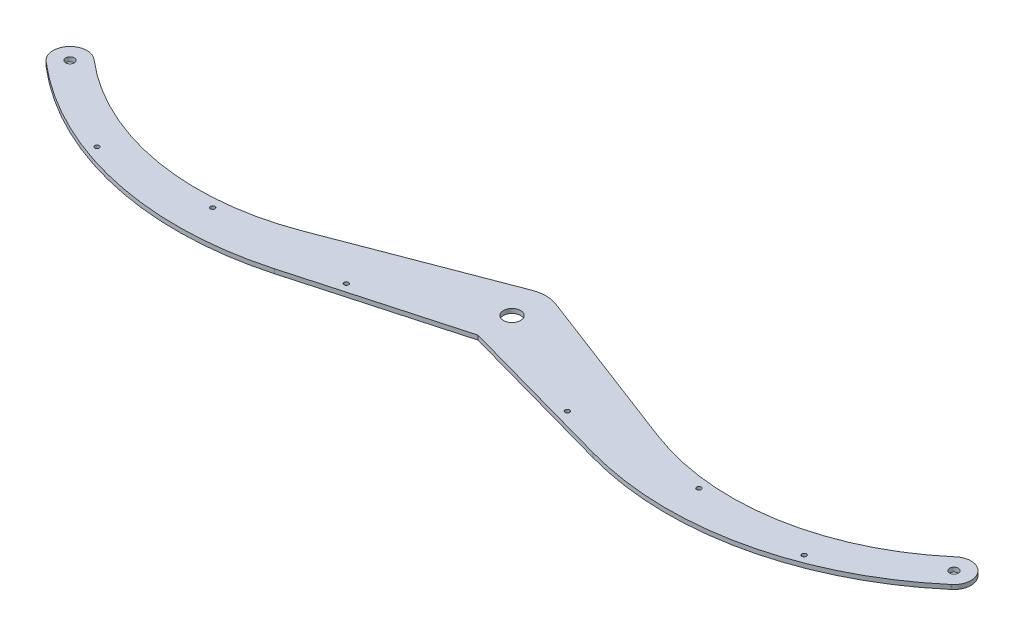
ISO-10303-21;
HEADER;
FILE_DESCRIPTION(('STEP AP214'),'2;1');
FILE_NAME('part.step','',(''),(''),'','','');
FILE_SCHEMA(('AUTOMOTIVE_DESIGN { 1 0 10303 214 1 1 1 1 }'));
ENDSEC;
DATA;
#1=APPLICATION_CONTEXT('core data for automotive mechanical design processes');
#2=APPLICATION_PROTOCOL_DEFINITION('international standard','automotive_design',2000,#1);
#3=PRODUCT_CONTEXT('',#1,'mechanical');
#4=PRODUCT('Part','Part','',(#3));
#5=PRODUCT_RELATED_PRODUCT_CATEGORY('part','',(#4));
#6=PRODUCT_DEFINITION_FORMATION('','',#4);
#7=PRODUCT_DEFINITION_CONTEXT('part definition',#1,'design');
#8=PRODUCT_DEFINITION('design','',#6,#7);
#9=PRODUCT_DEFINITION_SHAPE('','',#8);
#10=(LENGTH_UNIT() NAMED_UNIT(*) SI_UNIT(.MILLI.,.METRE.));
#11=(NAMED_UNIT(*) PLANE_ANGLE_UNIT() SI_UNIT($,.RADIAN.));
#12=(NAMED_UNIT(*) SI_UNIT($,.STERADIAN.) SOLID_ANGLE_UNIT());
#13=UNCERTAINTY_MEASURE_WITH_UNIT(LENGTH_MEASURE(1.E-05),#10,'distance_accuracy_value','');
#14=(GEOMETRIC_REPRESENTATION_CONTEXT(3) GLOBAL_UNCERTAINTY_ASSIGNED_CONTEXT((#13)) GLOBAL_UNIT_ASSIGNED_CONTEXT((#10,
#11,#12)) REPRESENTATION_CONTEXT('',''));
#15=CARTESIAN_POINT('',(0.,0.,0.));
#16=DIRECTION('',(0.,0.,1.));
#17=DIRECTION('',(1.,0.,0.));
#18=AXIS2_PLACEMENT_3D('',#15,#16,#17);
#19=CARTESIAN_POINT('',(180.096320348793,3.18,-168.847526717338));
#20=DIRECTION('',(0.,-1.,0.));
#21=DIRECTION('',(0.,0.,-1.));
#22=AXIS2_PLACEMENT_3D('',#19,#20,#21);
#23=CYLINDRICAL_SURFACE('',#22,235.);
#24=CARTESIAN_POINT('',(180.096320348793,0.,-168.847526717338));
#25=DIRECTION('',(0.,1.,0.));
#26=DIRECTION('',(0.,0.,-1.));
#27=AXIS2_PLACEMENT_3D('',#24,#25,#26);
#28=CIRCLE('',#27,235.);
#29=CARTESIAN_POINT('',(117.15763827493,0.,57.5674071956115));
#30=VERTEX_POINT('',#29);
#31=CARTESIAN_POINT('',(332.690811024301,0.,9.86990784203095));
#32=VERTEX_POINT('',#31);
#33=EDGE_CURVE('E188',#30,#32,#28,.T.);
#34=ORIENTED_EDGE('',*,*,#33,.T.);
#35=DIRECTION('',(0.,-1.,0.));
#36=VECTOR('',#35,1.);
#37=CARTESIAN_POINT('',(332.690811024301,3.18,9.86990784203095));
#38=LINE('',#37,#36);
#39=CARTESIAN_POINT('',(332.690811024301,3.18,9.86990784203095));
#40=VERTEX_POINT('',#39);
#41=EDGE_CURVE('E11',#40,#32,#38,.T.);
#42=ORIENTED_EDGE('',*,*,#41,.F.);
#43=CARTESIAN_POINT('',(180.096320348793,3.18,-168.847526717338));
#44=DIRECTION('',(0.,1.,0.));
#45=DIRECTION('',(0.,0.,-1.));
#46=AXIS2_PLACEMENT_3D('',#43,#44,#45);
#47=CIRCLE('',#46,235.);
#48=CARTESIAN_POINT('',(117.15763827493,3.18,57.5674071956115));
#49=VERTEX_POINT('',#48);
#50=EDGE_CURVE('E232',#49,#40,#47,.T.);
#51=ORIENTED_EDGE('',*,*,#50,.F.);
#52=DIRECTION('',(0.,-1.,0.));
#53=VECTOR('',#52,1.);
#54=CARTESIAN_POINT('',(117.15763827493,3.18,57.5674071956115));
#55=LINE('',#54,#53);
#56=EDGE_CURVE('E184',#49,#30,#55,.T.);
#57=ORIENTED_EDGE('',*,*,#56,.T.);
#58=EDGE_LOOP('',(#34,#42,#51,#57));
#59=FACE_BOUND('',#58,.T.);
#60=ADVANCED_FACE('F45',(#59),#23,.T.);
#61=CARTESIAN_POINT('',(333.116728227421,3.18,9.50624651911532));
#62=DIRECTION('',(-0.649338258193775,0.,-0.760499721529123));
#63=DIRECTION('',(-0.760499721529123,0.,0.649338258193775));
#64=AXIS2_PLACEMENT_3D('',#61,#62,#63);
#65=PLANE('',#64);
#66=DIRECTION('',(0.760499721529123,0.,-0.649338258193775));
#67=VECTOR('',#66,1.);
#68=CARTESIAN_POINT('',(333.116728227421,0.,9.50624651911532));
#69=LINE('',#68,#67);
#70=CARTESIAN_POINT('',(333.116728227421,0.,9.50624651911534));
#71=VERTEX_POINT('',#70);
#72=EDGE_CURVE('E192',#32,#71,#69,.T.);
#73=ORIENTED_EDGE('',*,*,#72,.T.);
#74=DIRECTION('',(0.,-1.,0.));
#75=VECTOR('',#74,1.);
#76=CARTESIAN_POINT('',(333.116728227421,3.18,9.50624651911534));
#77=LINE('',#76,#75);
#78=CARTESIAN_POINT('',(333.116728227421,3.18,9.50624651911534));
#79=VERTEX_POINT('',#78);
#80=EDGE_CURVE('E54',#79,#71,#77,.T.);
#81=ORIENTED_EDGE('',*,*,#80,.F.);
#82=DIRECTION('',(0.760499721529123,0.,-0.649338258193775));
#83=VECTOR('',#82,1.);
#84=CARTESIAN_POINT('',(333.116728227421,3.18,9.50624651911532));
#85=LINE('',#84,#83);
#86=EDGE_CURVE('E126',#40,#79,#85,.T.);
#87=ORIENTED_EDGE('',*,*,#86,.F.);
#88=ORIENTED_EDGE('',*,*,#41,.T.);
#89=EDGE_LOOP('',(#73,#81,#87,#88));
#90=FACE_BOUND('',#89,.T.);
#91=ADVANCED_FACE('F348',(#90),#65,.F.);
#92=CARTESIAN_POINT('',(325.,3.18,0.));
#93=DIRECTION('',(0.,-1.,0.));
#94=DIRECTION('',(0.,0.,-1.));
#95=AXIS2_PLACEMENT_3D('',#92,#93,#94);
#96=CYLINDRICAL_SURFACE('',#95,12.4999999999999);
#97=CARTESIAN_POINT('',(325.,0.,0.));
#98=DIRECTION('',(0.,1.,0.));
#99=DIRECTION('',(0.,0.,-1.));
#100=AXIS2_PLACEMENT_3D('',#97,#98,#99);
#101=CIRCLE('',#100,12.4999999999999);
#102=CARTESIAN_POINT('',(316.883271772579,0.,-9.50624651911536));
#103=VERTEX_POINT('',#102);
#104=EDGE_CURVE('E196',#71,#103,#101,.T.);
#105=ORIENTED_EDGE('',*,*,#104,.T.);
#106=DIRECTION('',(0.,-1.,0.));
#107=VECTOR('',#106,1.);
#108=CARTESIAN_POINT('',(316.883271772579,3.18,-9.50624651911536));
#109=LINE('',#108,#107);
#110=CARTESIAN_POINT('',(316.883271772579,3.18,-9.50624651911536));
#111=VERTEX_POINT('',#110);
#112=EDGE_CURVE('E271',#111,#103,#109,.T.);
#113=ORIENTED_EDGE('',*,*,#112,.F.);
#114=CARTESIAN_POINT('',(325.,3.18,0.));
#115=DIRECTION('',(0.,1.,0.));
#116=DIRECTION('',(0.,0.,-1.));
#117=AXIS2_PLACEMENT_3D('',#114,#115,#116);
#118=CIRCLE('',#117,12.4999999999999);
#119=EDGE_CURVE('E281',#79,#111,#118,.T.);
#120=ORIENTED_EDGE('',*,*,#119,.F.);
#121=ORIENTED_EDGE('',*,*,#80,.T.);
#122=EDGE_LOOP('',(#105,#113,#120,#121));
#123=FACE_BOUND('',#122,.T.);
#124=ADVANCED_FACE('F279',(#123),#96,.T.);
#125=CARTESIAN_POINT('',(316.883271772579,3.18,-9.50624651911536));
#126=DIRECTION('',(0.64933825819358,0.,0.76049972152929));
#127=DIRECTION('',(0.76049972152929,0.,-0.64933825819358));
#128=AXIS2_PLACEMENT_3D('',#125,#126,#127);
#129=PLANE('',#128);
#130=DIRECTION('',(-0.76049972152929,0.,0.64933825819358));
#131=VECTOR('',#130,1.);
#132=CARTESIAN_POINT('',(316.883271772579,0.,-9.50624651911536));
#133=LINE('',#132,#131);
#134=CARTESIAN_POINT('',(316.45735456946,0.,-9.1425851961999));
#135=VERTEX_POINT('',#134);
#136=EDGE_CURVE('E199',#103,#135,#133,.T.);
#137=ORIENTED_EDGE('',*,*,#136,.T.);
#138=DIRECTION('',(0.,-1.,0.));
#139=VECTOR('',#138,1.);
#140=CARTESIAN_POINT('',(316.45735456946,3.18,-9.1425851961999));
#141=LINE('',#140,#139);
#142=CARTESIAN_POINT('',(316.45735456946,3.18,-9.1425851961999));
#143=VERTEX_POINT('',#142);
#144=EDGE_CURVE('E267',#143,#135,#141,.T.);
#145=ORIENTED_EDGE('',*,*,#144,.F.);
#146=DIRECTION('',(-0.76049972152929,0.,0.64933825819358));
#147=VECTOR('',#146,1.);
#148=CARTESIAN_POINT('',(316.883271772579,3.18,-9.50624651911536));
#149=LINE('',#148,#147);
#150=EDGE_CURVE('E300',#111,#143,#149,.T.);
#151=ORIENTED_EDGE('',*,*,#150,.F.);
#152=ORIENTED_EDGE('',*,*,#112,.T.);
#153=EDGE_LOOP('',(#137,#145,#151,#152));
#154=FACE_BOUND('',#153,.T.);
#155=ADVANCED_FACE('F290',(#154),#129,.F.);
#156=CARTESIAN_POINT('',(196.329776803635,3.18,-149.835033679108));
#157=DIRECTION('',(0.,-1.,0.));
#158=DIRECTION('',(0.,0.,-1.));
#159=AXIS2_PLACEMENT_3D('',#156,#157,#158);
#160=CYLINDRICAL_SURFACE('',#159,185.);
#161=CARTESIAN_POINT('',(196.329776803635,0.,-149.835033679108));
#162=DIRECTION('',(0.,-1.,0.));
#163=DIRECTION('',(0.,0.,-1.));
#164=AXIS2_PLACEMENT_3D('',#161,#162,#163);
#165=CIRCLE('',#164,185.);
#166=CARTESIAN_POINT('',(130.352994696381,0.,23.0003337164916));
#167=VERTEX_POINT('',#166);
#168=EDGE_CURVE('E202',#135,#167,#165,.T.);
#169=ORIENTED_EDGE('',*,*,#168,.T.);
#170=DIRECTION('',(0.,-1.,0.));
#171=VECTOR('',#170,1.);
#172=CARTESIAN_POINT('',(130.352994696381,3.18,23.0003337164916));
#173=LINE('',#172,#171);
#174=CARTESIAN_POINT('',(130.352994696381,3.18,23.0003337164916));
#175=VERTEX_POINT('',#174);
#176=EDGE_CURVE('E263',#175,#167,#173,.T.);
#177=ORIENTED_EDGE('',*,*,#176,.F.);
#178=CARTESIAN_POINT('',(196.329776803635,3.18,-149.835033679108));
#179=DIRECTION('',(0.,-1.,0.));
#180=DIRECTION('',(0.,0.,-1.));
#181=AXIS2_PLACEMENT_3D('',#178,#179,#180);
#182=CIRCLE('',#181,185.);
#183=EDGE_CURVE('E296',#143,#175,#182,.T.);
#184=ORIENTED_EDGE('',*,*,#183,.F.);
#185=ORIENTED_EDGE('',*,*,#144,.T.);
#186=EDGE_LOOP('',(#169,#177,#184,#185));
#187=FACE_BOUND('',#186,.T.);
#188=ADVANCED_FACE('F294',(#187),#160,.F.);
#189=CARTESIAN_POINT('',(130.352994696381,3.18,23.0003337164916));
#190=DIRECTION('',(-0.356631254633807,0.,0.934245229165403));
#191=DIRECTION('',(0.934245229165403,0.,0.356631254633807));
#192=AXIS2_PLACEMENT_3D('',#189,#190,#191);
#193=PLANE('',#192);
#194=DIRECTION('',(-0.934245229165403,0.,-0.356631254633807));
#195=VECTOR('',#194,1.);
#196=CARTESIAN_POINT('',(130.352994696381,0.,23.0003337164916));
#197=LINE('',#196,#195);
#198=CARTESIAN_POINT('',(8.91578136584515,0.,-23.356130729135));
#199=VERTEX_POINT('',#198);
#200=EDGE_CURVE('E205',#167,#199,#197,.T.);
#201=ORIENTED_EDGE('',*,*,#200,.T.);
#202=DIRECTION('',(0.,-1.,0.));
#203=VECTOR('',#202,1.);
#204=CARTESIAN_POINT('',(8.91578136584515,3.18,-23.356130729135));
#205=LINE('',#204,#203);
#206=CARTESIAN_POINT('',(8.91578136584515,3.18,-23.356130729135));
#207=VERTEX_POINT('',#206);
#208=EDGE_CURVE('E259',#207,#199,#205,.T.);
#209=ORIENTED_EDGE('',*,*,#208,.F.);
#210=DIRECTION('',(-0.934245229165403,0.,-0.356631254633807));
#211=VECTOR('',#210,1.);
#212=CARTESIAN_POINT('',(130.352994696381,3.18,23.0003337164916));
#213=LINE('',#212,#211);
#214=EDGE_CURVE('E299',#175,#207,#213,.T.);
#215=ORIENTED_EDGE('',*,*,#214,.F.);
#216=ORIENTED_EDGE('',*,*,#176,.T.);
#217=EDGE_LOOP('',(#201,#209,#215,#216));
#218=FACE_BOUND('',#217,.T.);
#219=ADVANCED_FACE('F361',(#218),#193,.F.);
#220=CARTESIAN_POINT('',(0.,3.18,0.));
#221=DIRECTION('',(0.,-1.,0.));
#222=DIRECTION('',(0.,0.,-1.));
#223=AXIS2_PLACEMENT_3D('',#220,#221,#222);
#224=CYLINDRICAL_SURFACE('',#223,25.);
#225=CARTESIAN_POINT('',(0.,0.,0.));
#226=DIRECTION('',(0.,1.,0.));
#227=DIRECTION('',(0.,0.,1.));
#228=AXIS2_PLACEMENT_3D('',#225,#226,#227);
#229=CIRCLE('',#228,25.);
#230=CARTESIAN_POINT('',(-8.91578136584515,0.,-23.356130729135));
#231=VERTEX_POINT('',#230);
#232=EDGE_CURVE('E208',#199,#231,#229,.T.);
#233=ORIENTED_EDGE('',*,*,#232,.T.);
#234=DIRECTION('',(0.,-1.,0.));
#235=VECTOR('',#234,1.);
#236=CARTESIAN_POINT('',(-8.91578136584515,3.18,-23.356130729135));
#237=LINE('',#236,#235);
#238=CARTESIAN_POINT('',(-8.91578136584515,3.18,-23.356130729135));
#239=VERTEX_POINT('',#238);
#240=EDGE_CURVE('E255',#239,#231,#237,.T.);
#241=ORIENTED_EDGE('',*,*,#240,.F.);
#242=CARTESIAN_POINT('',(0.,3.18,0.));
#243=DIRECTION('',(0.,1.,0.));
#244=DIRECTION('',(0.,0.,1.));
#245=AXIS2_PLACEMENT_3D('',#242,#243,#244);
#246=CIRCLE('',#245,25.);
#247=EDGE_CURVE('E304',#207,#239,#246,.T.);
#248=ORIENTED_EDGE('',*,*,#247,.F.);
#249=ORIENTED_EDGE('',*,*,#208,.T.);
#250=EDGE_LOOP('',(#233,#241,#248,#249));
#251=FACE_BOUND('',#250,.T.);
#252=ADVANCED_FACE('F364',(#251),#224,.T.);
#253=CARTESIAN_POINT('',(-130.352994696381,3.18,23.0003337164916));
#254=DIRECTION('',(0.356631254633807,0.,0.934245229165403));
#255=DIRECTION('',(0.934245229165403,0.,-0.356631254633807));
#256=AXIS2_PLACEMENT_3D('',#253,#254,#255);
#257=PLANE('',#256);
#258=DIRECTION('',(-0.934245229165403,0.,0.356631254633807));
#259=VECTOR('',#258,1.);
#260=CARTESIAN_POINT('',(-130.352994696381,0.,23.0003337164916));
#261=LINE('',#260,#259);
#262=CARTESIAN_POINT('',(-130.352994696381,0.,23.0003337164916));
#263=VERTEX_POINT('',#262);
#264=EDGE_CURVE('E211',#231,#263,#261,.T.);
#265=ORIENTED_EDGE('',*,*,#264,.T.);
#266=DIRECTION('',(0.,-1.,0.));
#267=VECTOR('',#266,1.);
#268=CARTESIAN_POINT('',(-130.352994696381,3.18,23.0003337164916));
#269=LINE('',#268,#267);
#270=CARTESIAN_POINT('',(-130.352994696381,3.18,23.0003337164916));
#271=VERTEX_POINT('',#270);
#272=EDGE_CURVE('E251',#271,#263,#269,.T.);
#273=ORIENTED_EDGE('',*,*,#272,.F.);
#274=DIRECTION('',(-0.934245229165403,0.,0.356631254633807));
#275=VECTOR('',#274,1.);
#276=CARTESIAN_POINT('',(-130.352994696381,3.18,23.0003337164916));
#277=LINE('',#276,#275);
#278=EDGE_CURVE('E311',#239,#271,#277,.T.);
#279=ORIENTED_EDGE('',*,*,#278,.F.);
#280=ORIENTED_EDGE('',*,*,#240,.T.);
#281=EDGE_LOOP('',(#265,#273,#279,#280));
#282=FACE_BOUND('',#281,.T.);
#283=ADVANCED_FACE('F368',(#282),#257,.F.);
#284=CARTESIAN_POINT('',(-196.329776803635,3.18,-149.835033679108));
#285=DIRECTION('',(0.,-1.,0.));
#286=DIRECTION('',(0.,0.,-1.));
#287=AXIS2_PLACEMENT_3D('',#284,#285,#286);
#288=CYLINDRICAL_SURFACE('',#287,185.);
#289=CARTESIAN_POINT('',(-196.329776803635,0.,-149.835033679108));
#290=DIRECTION('',(0.,-1.,0.));
#291=DIRECTION('',(0.,0.,1.));
#292=AXIS2_PLACEMENT_3D('',#289,#290,#291);
#293=CIRCLE('',#292,185.);
#294=CARTESIAN_POINT('',(-316.45735456946,0.,-9.14258519619988));
#295=VERTEX_POINT('',#294);
#296=EDGE_CURVE('E214',#263,#295,#293,.T.);
#297=ORIENTED_EDGE('',*,*,#296,.T.);
#298=DIRECTION('',(0.,-1.,0.));
#299=VECTOR('',#298,1.);
#300=CARTESIAN_POINT('',(-316.45735456946,3.18,-9.14258519619988));
#301=LINE('',#300,#299);
#302=CARTESIAN_POINT('',(-316.45735456946,3.18,-9.14258519619988));
#303=VERTEX_POINT('',#302);
#304=EDGE_CURVE('E247',#303,#295,#301,.T.);
#305=ORIENTED_EDGE('',*,*,#304,.F.);
#306=CARTESIAN_POINT('',(-196.329776803635,3.18,-149.835033679108));
#307=DIRECTION('',(0.,-1.,0.));
#308=DIRECTION('',(0.,0.,1.));
#309=AXIS2_PLACEMENT_3D('',#306,#307,#308);
#310=CIRCLE('',#309,185.);
#311=EDGE_CURVE('E314',#271,#303,#310,.T.);
#312=ORIENTED_EDGE('',*,*,#311,.F.);
#313=ORIENTED_EDGE('',*,*,#272,.T.);
#314=EDGE_LOOP('',(#297,#305,#312,#313));
#315=FACE_BOUND('',#314,.T.);
#316=ADVANCED_FACE('F372',(#315),#288,.F.);
#317=CARTESIAN_POINT('',(-316.883271772579,3.18,-9.50624651911536));
#318=DIRECTION('',(-0.64933825819358,0.,0.76049972152929));
#319=DIRECTION('',(0.76049972152929,0.,0.64933825819358));
#320=AXIS2_PLACEMENT_3D('',#317,#318,#319);
#321=PLANE('',#320);
#322=DIRECTION('',(-0.76049972152929,0.,-0.64933825819358));
#323=VECTOR('',#322,1.);
#324=CARTESIAN_POINT('',(-316.883271772579,0.,-9.50624651911536));
#325=LINE('',#324,#323);
#326=CARTESIAN_POINT('',(-316.883271772579,0.,-9.50624651911535));
#327=VERTEX_POINT('',#326);
#328=EDGE_CURVE('E217',#295,#327,#325,.T.);
#329=ORIENTED_EDGE('',*,*,#328,.T.);
#330=DIRECTION('',(0.,-1.,0.));
#331=VECTOR('',#330,1.);
#332=CARTESIAN_POINT('',(-316.883271772579,3.18,-9.50624651911535));
#333=LINE('',#332,#331);
#334=CARTESIAN_POINT('',(-316.883271772579,3.18,-9.50624651911535));
#335=VERTEX_POINT('',#334);
#336=EDGE_CURVE('E243',#335,#327,#333,.T.);
#337=ORIENTED_EDGE('',*,*,#336,.F.);
#338=DIRECTION('',(-0.76049972152929,0.,-0.64933825819358));
#339=VECTOR('',#338,1.);
#340=CARTESIAN_POINT('',(-316.883271772579,3.18,-9.50624651911536));
#341=LINE('',#340,#339);
#342=EDGE_CURVE('E317',#303,#335,#341,.T.);
#343=ORIENTED_EDGE('',*,*,#342,.F.);
#344=ORIENTED_EDGE('',*,*,#304,.T.);
#345=EDGE_LOOP('',(#329,#337,#343,#344));
#346=FACE_BOUND('',#345,.T.);
#347=ADVANCED_FACE('F376',(#346),#321,.F.);
#348=CARTESIAN_POINT('',(-325.,3.18,0.));
#349=DIRECTION('',(0.,-1.,0.));
#350=DIRECTION('',(0.,0.,-1.));
#351=AXIS2_PLACEMENT_3D('',#348,#349,#350);
#352=CYLINDRICAL_SURFACE('',#351,12.4999999999999);
#353=CARTESIAN_POINT('',(-325.,0.,0.));
#354=DIRECTION('',(0.,1.,0.));
#355=DIRECTION('',(0.,0.,1.));
#356=AXIS2_PLACEMENT_3D('',#353,#354,#355);
#357=CIRCLE('',#356,12.4999999999999);
#358=CARTESIAN_POINT('',(-333.116728227421,0.,9.50624651911532));
#359=VERTEX_POINT('',#358);
#360=EDGE_CURVE('E220',#327,#359,#357,.T.);
#361=ORIENTED_EDGE('',*,*,#360,.T.);
#362=DIRECTION('',(0.,-1.,0.));
#363=VECTOR('',#362,1.);
#364=CARTESIAN_POINT('',(-333.116728227421,3.18,9.50624651911532));
#365=LINE('',#364,#363);
#366=CARTESIAN_POINT('',(-333.116728227421,3.18,9.50624651911532));
#367=VERTEX_POINT('',#366);
#368=EDGE_CURVE('E239',#367,#359,#365,.T.);
#369=ORIENTED_EDGE('',*,*,#368,.F.);
#370=CARTESIAN_POINT('',(-325.,3.18,0.));
#371=DIRECTION('',(0.,1.,0.));
#372=DIRECTION('',(0.,0.,1.));
#373=AXIS2_PLACEMENT_3D('',#370,#371,#372);
#374=CIRCLE('',#373,12.4999999999999);
#375=EDGE_CURVE('E320',#335,#367,#374,.T.);
#376=ORIENTED_EDGE('',*,*,#375,.F.);
#377=ORIENTED_EDGE('',*,*,#336,.T.);
#378=EDGE_LOOP('',(#361,#369,#376,#377));
#379=FACE_BOUND('',#378,.T.);
#380=ADVANCED_FACE('F328',(#379),#352,.T.);
#381=CARTESIAN_POINT('',(-333.116728227421,3.18,9.50624651911532));
#382=DIRECTION('',(0.649338258193775,0.,-0.760499721529123));
#383=DIRECTION('',(-0.760499721529123,0.,-0.649338258193775));
#384=AXIS2_PLACEMENT_3D('',#381,#382,#383);
#385=PLANE('',#384);
#386=DIRECTION('',(0.760499721529123,0.,0.649338258193775));
#387=VECTOR('',#386,1.);
#388=CARTESIAN_POINT('',(-333.116728227421,0.,9.50624651911532));
#389=LINE('',#388,#387);
#390=CARTESIAN_POINT('',(-332.690811024301,0.,9.8699078420309));
#391=VERTEX_POINT('',#390);
#392=EDGE_CURVE('E223',#359,#391,#389,.T.);
#393=ORIENTED_EDGE('',*,*,#392,.T.);
#394=DIRECTION('',(0.,-1.,0.));
#395=VECTOR('',#394,1.);
#396=CARTESIAN_POINT('',(-332.690811024301,3.18,9.8699078420309));
#397=LINE('',#396,#395);
#398=CARTESIAN_POINT('',(-332.690811024301,3.18,9.8699078420309));
#399=VERTEX_POINT('',#398);
#400=EDGE_CURVE('E177',#399,#391,#397,.T.);
#401=ORIENTED_EDGE('',*,*,#400,.F.);
#402=DIRECTION('',(0.760499721529123,0.,0.649338258193775));
#403=VECTOR('',#402,1.);
#404=CARTESIAN_POINT('',(-333.116728227421,3.18,9.50624651911532));
#405=LINE('',#404,#403);
#406=EDGE_CURVE('E166',#367,#399,#405,.T.);
#407=ORIENTED_EDGE('',*,*,#406,.F.);
#408=ORIENTED_EDGE('',*,*,#368,.T.);
#409=EDGE_LOOP('',(#393,#401,#407,#408));
#410=FACE_BOUND('',#409,.T.);
#411=ADVANCED_FACE('F332',(#410),#385,.F.);
#412=CARTESIAN_POINT('',(-180.096320348793,3.18,-168.847526717338));
#413=DIRECTION('',(0.,-1.,0.));
#414=DIRECTION('',(0.,0.,-1.));
#415=AXIS2_PLACEMENT_3D('',#412,#413,#414);
#416=CYLINDRICAL_SURFACE('',#415,235.);
#417=CARTESIAN_POINT('',(-180.096320348793,0.,-168.847526717338));
#418=DIRECTION('',(0.,1.,0.));
#419=DIRECTION('',(0.,0.,1.));
#420=AXIS2_PLACEMENT_3D('',#417,#418,#419);
#421=CIRCLE('',#420,235.);
#422=CARTESIAN_POINT('',(-117.15763827493,0.,57.5674071956115));
#423=VERTEX_POINT('',#422);
#424=EDGE_CURVE('E175',#391,#423,#421,.T.);
#425=ORIENTED_EDGE('',*,*,#424,.T.);
#426=DIRECTION('',(0.,-1.,0.));
#427=VECTOR('',#426,1.);
#428=CARTESIAN_POINT('',(-117.15763827493,3.18,57.5674071956115));
#429=LINE('',#428,#427);
#430=CARTESIAN_POINT('',(-117.15763827493,3.18,57.5674071956115));
#431=VERTEX_POINT('',#430);
#432=EDGE_CURVE('E172',#431,#423,#429,.T.);
#433=ORIENTED_EDGE('',*,*,#432,.F.);
#434=CARTESIAN_POINT('',(-180.096320348793,3.18,-168.847526717338));
#435=DIRECTION('',(0.,1.,0.));
#436=DIRECTION('',(0.,0.,1.));
#437=AXIS2_PLACEMENT_3D('',#434,#435,#436);
#438=CIRCLE('',#437,235.);
#439=EDGE_CURVE('E160',#399,#431,#438,.T.);
#440=ORIENTED_EDGE('',*,*,#439,.F.);
#441=ORIENTED_EDGE('',*,*,#400,.T.);
#442=EDGE_LOOP('',(#425,#433,#440,#441));
#443=FACE_BOUND('',#442,.T.);
#444=ADVANCED_FACE('F173',(#443),#416,.T.);
#445=CARTESIAN_POINT('',(-117.15763827493,3.18,57.5674071956115));
#446=DIRECTION('',(-0.267824179037715,0.,-0.963467803884891));
#447=DIRECTION('',(-0.963467803884891,0.,0.267824179037715));
#448=AXIS2_PLACEMENT_3D('',#445,#446,#447);
#449=PLANE('',#448);
#450=DIRECTION('',(0.963467803884891,0.,-0.267824179037715));
#451=VECTOR('',#450,1.);
#452=CARTESIAN_POINT('',(-117.15763827493,0.,57.5674071956115));
#453=LINE('',#452,#451);
#454=CARTESIAN_POINT('',(0.,0.,25.));
#455=VERTEX_POINT('',#454);
#456=EDGE_CURVE('E112',#423,#455,#453,.T.);
#457=ORIENTED_EDGE('',*,*,#456,.T.);
#458=DIRECTION('',(0.,-1.,0.));
#459=VECTOR('',#458,1.);
#460=CARTESIAN_POINT('',(0.,3.18,25.));
#461=LINE('',#460,#459);
#462=CARTESIAN_POINT('',(0.,3.18,25.));
#463=VERTEX_POINT('',#462);
#464=EDGE_CURVE('E178',#463,#455,#461,.T.);
#465=ORIENTED_EDGE('',*,*,#464,.F.);
#466=DIRECTION('',(0.963467803884891,0.,-0.267824179037715));
#467=VECTOR('',#466,1.);
#468=CARTESIAN_POINT('',(-117.15763827493,3.18,57.5674071956115));
#469=LINE('',#468,#467);
#470=EDGE_CURVE('E164',#431,#463,#469,.T.);
#471=ORIENTED_EDGE('',*,*,#470,.F.);
#472=ORIENTED_EDGE('',*,*,#432,.T.);
#473=EDGE_LOOP('',(#457,#465,#471,#472));
#474=FACE_BOUND('',#473,.T.);
#475=ADVANCED_FACE('F180',(#474),#449,.F.);
#476=CARTESIAN_POINT('',(117.15763827493,3.18,57.5674071956115));
#477=DIRECTION('',(0.267824179037715,0.,-0.963467803884891));
#478=DIRECTION('',(-0.963467803884891,0.,-0.267824179037715));
#479=AXIS2_PLACEMENT_3D('',#476,#477,#478);
#480=PLANE('',#479);
#481=DIRECTION('',(0.963467803884891,0.,0.267824179037715));
#482=VECTOR('',#481,1.);
#483=CARTESIAN_POINT('',(117.15763827493,0.,57.5674071956115));
#484=LINE('',#483,#482);
#485=EDGE_CURVE('E118',#455,#30,#484,.T.);
#486=ORIENTED_EDGE('',*,*,#485,.T.);
#487=ORIENTED_EDGE('',*,*,#56,.F.);
#488=DIRECTION('',(0.963467803884891,0.,0.267824179037715));
#489=VECTOR('',#488,1.);
#490=CARTESIAN_POINT('',(117.15763827493,3.18,57.5674071956115));
#491=LINE('',#490,#489);
#492=EDGE_CURVE('E62',#463,#49,#491,.T.);
#493=ORIENTED_EDGE('',*,*,#492,.F.);
#494=ORIENTED_EDGE('',*,*,#464,.T.);
#495=EDGE_LOOP('',(#486,#487,#493,#494));
#496=FACE_BOUND('',#495,.T.);
#497=ADVANCED_FACE('F336',(#496),#480,.F.);
#498=CARTESIAN_POINT('',(180.096320348793,3.18,-168.847526717338));
#499=DIRECTION('',(0.,-1.,0.));
#500=DIRECTION('',(0.,0.,-1.));
#501=AXIS2_PLACEMENT_3D('',#498,#499,#500);
#502=PLANE('',#501);
#503=CARTESIAN_POINT('',(-325.,3.18,0.));
#504=DIRECTION('',(0.,1.,0.));
#505=DIRECTION('',(0.,0.,1.));
#506=AXIS2_PLACEMENT_3D('',#503,#504,#505);
#507=CIRCLE('',#506,3.17499999999997);
#508=CARTESIAN_POINT('',(-325.,3.18,3.17499999999997));
#509=VERTEX_POINT('',#508);
#510=EDGE_CURVE('E512',#509,#509,#507,.T.);
#511=ORIENTED_EDGE('',*,*,#510,.F.);
#512=EDGE_LOOP('',(#511));
#513=FACE_BOUND('',#512,.T.);
#514=CARTESIAN_POINT('',(-260.,3.18,45.1511202880167));
#515=DIRECTION('',(0.,1.,0.));
#516=DIRECTION('',(0.,0.,1.));
#517=AXIS2_PLACEMENT_3D('',#514,#515,#516);
#518=CIRCLE('',#517,1.64999999999999);
#519=CARTESIAN_POINT('',(-260.,3.18,46.8011202880167));
#520=VERTEX_POINT('',#519);
#521=EDGE_CURVE('E514',#520,#520,#518,.T.);
#522=ORIENTED_EDGE('',*,*,#521,.F.);
#523=EDGE_LOOP('',(#522));
#524=FACE_BOUND('',#523,.T.);
#525=CARTESIAN_POINT('',(-178.75,3.18,41.3278058068599));
#526=DIRECTION('',(0.,1.,0.));
#527=DIRECTION('',(0.,0.,1.));
#528=AXIS2_PLACEMENT_3D('',#525,#526,#527);
#529=CIRCLE('',#528,1.65000000000002);
#530=CARTESIAN_POINT('',(-178.75,3.18,42.9778058068599));
#531=VERTEX_POINT('',#530);
#532=EDGE_CURVE('E526',#531,#531,#529,.T.);
#533=ORIENTED_EDGE('',*,*,#532,.F.);
#534=EDGE_LOOP('',(#533));
#535=FACE_BOUND('',#534,.T.);
#536=CARTESIAN_POINT('',(-81.25,3.18,40.585824309926));
#537=DIRECTION('',(0.,1.,0.));
#538=DIRECTION('',(0.,0.,1.));
#539=AXIS2_PLACEMENT_3D('',#536,#537,#538);
#540=CIRCLE('',#539,1.65);
#541=CARTESIAN_POINT('',(-81.25,3.18,42.235824309926));
#542=VERTEX_POINT('',#541);
#543=EDGE_CURVE('E534',#542,#542,#540,.T.);
#544=ORIENTED_EDGE('',*,*,#543,.F.);
#545=EDGE_LOOP('',(#544));
#546=FACE_BOUND('',#545,.T.);
#547=CARTESIAN_POINT('',(0.,3.18,0.));
#548=DIRECTION('',(0.,1.,0.));
#549=DIRECTION('',(0.,0.,1.));
#550=AXIS2_PLACEMENT_3D('',#547,#548,#549);
#551=CIRCLE('',#550,6.35);
#552=CARTESIAN_POINT('',(0.,3.18,6.35));
#553=VERTEX_POINT('',#552);
#554=EDGE_CURVE('E542',#553,#553,#551,.T.);
#555=ORIENTED_EDGE('',*,*,#554,.F.);
#556=EDGE_LOOP('',(#555));
#557=FACE_BOUND('',#556,.T.);
#558=CARTESIAN_POINT('',(81.25,3.18,40.5858243099259));
#559=DIRECTION('',(0.,1.,0.));
#560=DIRECTION('',(0.,0.,-1.));
#561=AXIS2_PLACEMENT_3D('',#558,#559,#560);
#562=CIRCLE('',#561,1.65);
#563=CARTESIAN_POINT('',(81.25,3.18,38.9358243099259));
#564=VERTEX_POINT('',#563);
#565=EDGE_CURVE('E550',#564,#564,#562,.T.);
#566=ORIENTED_EDGE('',*,*,#565,.F.);
#567=EDGE_LOOP('',(#566));
#568=FACE_BOUND('',#567,.T.);
#569=CARTESIAN_POINT('',(178.75,3.18,41.3278058068599));
#570=DIRECTION('',(0.,1.,0.));
#571=DIRECTION('',(0.,0.,-1.));
#572=AXIS2_PLACEMENT_3D('',#569,#570,#571);
#573=CIRCLE('',#572,1.65000000000002);
#574=CARTESIAN_POINT('',(178.75,3.18,39.6778058068598));
#575=VERTEX_POINT('',#574);
#576=EDGE_CURVE('E558',#575,#575,#573,.T.);
#577=ORIENTED_EDGE('',*,*,#576,.F.);
#578=EDGE_LOOP('',(#577));
#579=FACE_BOUND('',#578,.T.);
#580=CARTESIAN_POINT('',(260.,3.18,45.1511202880167));
#581=DIRECTION('',(0.,1.,0.));
#582=DIRECTION('',(0.,0.,-1.));
#583=AXIS2_PLACEMENT_3D('',#580,#581,#582);
#584=CIRCLE('',#583,1.64999999999999);
#585=CARTESIAN_POINT('',(260.,3.18,43.5011202880167));
#586=VERTEX_POINT('',#585);
#587=EDGE_CURVE('E566',#586,#586,#584,.T.);
#588=ORIENTED_EDGE('',*,*,#587,.F.);
#589=EDGE_LOOP('',(#588));
#590=FACE_BOUND('',#589,.T.);
#591=CARTESIAN_POINT('',(325.,3.18,0.));
#592=DIRECTION('',(0.,1.,0.));
#593=DIRECTION('',(0.,0.,-1.));
#594=AXIS2_PLACEMENT_3D('',#591,#592,#593);
#595=CIRCLE('',#594,3.17499999999997);
#596=CARTESIAN_POINT('',(325.,3.18,-3.17500000000005));
#597=VERTEX_POINT('',#596);
#598=EDGE_CURVE('E574',#597,#597,#595,.T.);
#599=ORIENTED_EDGE('',*,*,#598,.F.);
#600=EDGE_LOOP('',(#599));
#601=FACE_BOUND('',#600,.T.);
#602=ORIENTED_EDGE('',*,*,#50,.T.);
#603=ORIENTED_EDGE('',*,*,#86,.T.);
#604=ORIENTED_EDGE('',*,*,#119,.T.);
#605=ORIENTED_EDGE('',*,*,#150,.T.);
#606=ORIENTED_EDGE('',*,*,#183,.T.);
#607=ORIENTED_EDGE('',*,*,#214,.T.);
#608=ORIENTED_EDGE('',*,*,#247,.T.);
#609=ORIENTED_EDGE('',*,*,#278,.T.);
#610=ORIENTED_EDGE('',*,*,#311,.T.);
#611=ORIENTED_EDGE('',*,*,#342,.T.);
#612=ORIENTED_EDGE('',*,*,#375,.T.);
#613=ORIENTED_EDGE('',*,*,#406,.T.);
#614=ORIENTED_EDGE('',*,*,#439,.T.);
#615=ORIENTED_EDGE('',*,*,#470,.T.);
#616=ORIENTED_EDGE('',*,*,#492,.T.);
#617=EDGE_LOOP('',(#602,#603,#604,#605,#606,#607,#608,#609,#610,#611,#612,#613,#614,#615,#616));
#618=FACE_BOUND('',#617,.T.);
#619=ADVANCED_FACE('F162',(#513,#524,#535,#546,#557,#568,#579,#590,#601,#618),#502,.F.);
#620=CARTESIAN_POINT('',(180.096320348793,0.,-168.847526717338));
#621=DIRECTION('',(0.,-1.,0.));
#622=DIRECTION('',(0.,0.,-1.));
#623=AXIS2_PLACEMENT_3D('',#620,#621,#622);
#624=PLANE('',#623);
#625=CARTESIAN_POINT('',(-325.,0.,0.));
#626=DIRECTION('',(0.,1.,0.));
#627=DIRECTION('',(0.,0.,1.));
#628=AXIS2_PLACEMENT_3D('',#625,#626,#627);
#629=CIRCLE('',#628,3.17499999999997);
#630=CARTESIAN_POINT('',(-325.,0.,3.17499999999997));
#631=VERTEX_POINT('',#630);
#632=EDGE_CURVE('E193',#631,#631,#629,.T.);
#633=ORIENTED_EDGE('',*,*,#632,.T.);
#634=EDGE_LOOP('',(#633));
#635=FACE_BOUND('',#634,.T.);
#636=CARTESIAN_POINT('',(-260.,0.,45.1511202880167));
#637=DIRECTION('',(0.,1.,0.));
#638=DIRECTION('',(0.,0.,1.));
#639=AXIS2_PLACEMENT_3D('',#636,#637,#638);
#640=CIRCLE('',#639,1.64999999999999);
#641=CARTESIAN_POINT('',(-260.,0.,46.8011202880167));
#642=VERTEX_POINT('',#641);
#643=EDGE_CURVE('E520',#642,#642,#640,.T.);
#644=ORIENTED_EDGE('',*,*,#643,.T.);
#645=EDGE_LOOP('',(#644));
#646=FACE_BOUND('',#645,.T.);
#647=CARTESIAN_POINT('',(-178.75,0.,41.3278058068599));
#648=DIRECTION('',(0.,1.,0.));
#649=DIRECTION('',(0.,0.,1.));
#650=AXIS2_PLACEMENT_3D('',#647,#648,#649);
#651=CIRCLE('',#650,1.65000000000002);
#652=CARTESIAN_POINT('',(-178.75,0.,42.9778058068599));
#653=VERTEX_POINT('',#652);
#654=EDGE_CURVE('E530',#653,#653,#651,.T.);
#655=ORIENTED_EDGE('',*,*,#654,.T.);
#656=EDGE_LOOP('',(#655));
#657=FACE_BOUND('',#656,.T.);
#658=CARTESIAN_POINT('',(-81.25,0.,40.585824309926));
#659=DIRECTION('',(0.,1.,0.));
#660=DIRECTION('',(0.,0.,1.));
#661=AXIS2_PLACEMENT_3D('',#658,#659,#660);
#662=CIRCLE('',#661,1.65);
#663=CARTESIAN_POINT('',(-81.25,0.,42.235824309926));
#664=VERTEX_POINT('',#663);
#665=EDGE_CURVE('E538',#664,#664,#662,.T.);
#666=ORIENTED_EDGE('',*,*,#665,.T.);
#667=EDGE_LOOP('',(#666));
#668=FACE_BOUND('',#667,.T.);
#669=CARTESIAN_POINT('',(0.,0.,0.));
#670=DIRECTION('',(0.,1.,0.));
#671=DIRECTION('',(0.,0.,1.));
#672=AXIS2_PLACEMENT_3D('',#669,#670,#671);
#673=CIRCLE('',#672,6.35);
#674=CARTESIAN_POINT('',(0.,0.,6.35));
#675=VERTEX_POINT('',#674);
#676=EDGE_CURVE('E546',#675,#675,#673,.T.);
#677=ORIENTED_EDGE('',*,*,#676,.T.);
#678=EDGE_LOOP('',(#677));
#679=FACE_BOUND('',#678,.T.);
#680=CARTESIAN_POINT('',(81.25,0.,40.5858243099259));
#681=DIRECTION('',(0.,1.,0.));
#682=DIRECTION('',(0.,0.,-1.));
#683=AXIS2_PLACEMENT_3D('',#680,#681,#682);
#684=CIRCLE('',#683,1.65);
#685=CARTESIAN_POINT('',(81.25,0.,38.9358243099259));
#686=VERTEX_POINT('',#685);
#687=EDGE_CURVE('E554',#686,#686,#684,.T.);
#688=ORIENTED_EDGE('',*,*,#687,.T.);
#689=EDGE_LOOP('',(#688));
#690=FACE_BOUND('',#689,.T.);
#691=CARTESIAN_POINT('',(178.75,0.,41.3278058068599));
#692=DIRECTION('',(0.,1.,0.));
#693=DIRECTION('',(0.,0.,-1.));
#694=AXIS2_PLACEMENT_3D('',#691,#692,#693);
#695=CIRCLE('',#694,1.65000000000002);
#696=CARTESIAN_POINT('',(178.75,0.,39.6778058068598));
#697=VERTEX_POINT('',#696);
#698=EDGE_CURVE('E562',#697,#697,#695,.T.);
#699=ORIENTED_EDGE('',*,*,#698,.T.);
#700=EDGE_LOOP('',(#699));
#701=FACE_BOUND('',#700,.T.);
#702=CARTESIAN_POINT('',(260.,0.,45.1511202880167));
#703=DIRECTION('',(0.,1.,0.));
#704=DIRECTION('',(0.,0.,-1.));
#705=AXIS2_PLACEMENT_3D('',#702,#703,#704);
#706=CIRCLE('',#705,1.64999999999999);
#707=CARTESIAN_POINT('',(260.,0.,43.5011202880167));
#708=VERTEX_POINT('',#707);
#709=EDGE_CURVE('E570',#708,#708,#706,.T.);
#710=ORIENTED_EDGE('',*,*,#709,.T.);
#711=EDGE_LOOP('',(#710));
#712=FACE_BOUND('',#711,.T.);
#713=CARTESIAN_POINT('',(325.,0.,0.));
#714=DIRECTION('',(0.,1.,0.));
#715=DIRECTION('',(0.,0.,-1.));
#716=AXIS2_PLACEMENT_3D('',#713,#714,#715);
#717=CIRCLE('',#716,3.17499999999997);
#718=CARTESIAN_POINT('',(325.,0.,-3.17500000000005));
#719=VERTEX_POINT('',#718);
#720=EDGE_CURVE('E578',#719,#719,#717,.T.);
#721=ORIENTED_EDGE('',*,*,#720,.T.);
#722=EDGE_LOOP('',(#721));
#723=FACE_BOUND('',#722,.T.);
#724=ORIENTED_EDGE('',*,*,#33,.F.);
#725=ORIENTED_EDGE('',*,*,#485,.F.);
#726=ORIENTED_EDGE('',*,*,#456,.F.);
#727=ORIENTED_EDGE('',*,*,#424,.F.);
#728=ORIENTED_EDGE('',*,*,#392,.F.);
#729=ORIENTED_EDGE('',*,*,#360,.F.);
#730=ORIENTED_EDGE('',*,*,#328,.F.);
#731=ORIENTED_EDGE('',*,*,#296,.F.);
#732=ORIENTED_EDGE('',*,*,#264,.F.);
#733=ORIENTED_EDGE('',*,*,#232,.F.);
#734=ORIENTED_EDGE('',*,*,#200,.F.);
#735=ORIENTED_EDGE('',*,*,#168,.F.);
#736=ORIENTED_EDGE('',*,*,#136,.F.);
#737=ORIENTED_EDGE('',*,*,#104,.F.);
#738=ORIENTED_EDGE('',*,*,#72,.F.);
#739=EDGE_LOOP('',(#724,#725,#726,#727,#728,#729,#730,#731,#732,#733,#734,#735,#736,#737,#738));
#740=FACE_BOUND('',#739,.T.);
#741=ADVANCED_FACE('F285',(#635,#646,#657,#668,#679,#690,#701,#712,#723,#740),#624,.T.);
#742=CARTESIAN_POINT('',(325.,0.,0.));
#743=DIRECTION('',(0.,1.,0.));
#744=DIRECTION('',(0.,0.,1.));
#745=AXIS2_PLACEMENT_3D('',#742,#743,#744);
#746=CYLINDRICAL_SURFACE('',#745,3.17499999999997);
#747=ORIENTED_EDGE('',*,*,#720,.F.);
#748=EDGE_LOOP('',(#747));
#749=FACE_BOUND('',#748,.T.);
#750=ORIENTED_EDGE('',*,*,#598,.T.);
#751=EDGE_LOOP('',(#750));
#752=FACE_BOUND('',#751,.T.);
#753=ADVANCED_FACE('F415',(#749,#752),#746,.F.);
#754=CARTESIAN_POINT('',(260.,0.,45.1511202880167));
#755=DIRECTION('',(0.,1.,0.));
#756=DIRECTION('',(0.,0.,1.));
#757=AXIS2_PLACEMENT_3D('',#754,#755,#756);
#758=CYLINDRICAL_SURFACE('',#757,1.64999999999999);
#759=ORIENTED_EDGE('',*,*,#709,.F.);
#760=EDGE_LOOP('',(#759));
#761=FACE_BOUND('',#760,.T.);
#762=ORIENTED_EDGE('',*,*,#587,.T.);
#763=EDGE_LOOP('',(#762));
#764=FACE_BOUND('',#763,.T.);
#765=ADVANCED_FACE('F424',(#761,#764),#758,.F.);
#766=CARTESIAN_POINT('',(178.75,0.,41.3278058068599));
#767=DIRECTION('',(0.,1.,0.));
#768=DIRECTION('',(0.,0.,1.));
#769=AXIS2_PLACEMENT_3D('',#766,#767,#768);
#770=CYLINDRICAL_SURFACE('',#769,1.65000000000002);
#771=ORIENTED_EDGE('',*,*,#698,.F.);
#772=EDGE_LOOP('',(#771));
#773=FACE_BOUND('',#772,.T.);
#774=ORIENTED_EDGE('',*,*,#576,.T.);
#775=EDGE_LOOP('',(#774));
#776=FACE_BOUND('',#775,.T.);
#777=ADVANCED_FACE('F434',(#773,#776),#770,.F.);
#778=CARTESIAN_POINT('',(81.25,0.,40.5858243099259));
#779=DIRECTION('',(0.,1.,0.));
#780=DIRECTION('',(0.,0.,1.));
#781=AXIS2_PLACEMENT_3D('',#778,#779,#780);
#782=CYLINDRICAL_SURFACE('',#781,1.65);
#783=ORIENTED_EDGE('',*,*,#687,.F.);
#784=EDGE_LOOP('',(#783));
#785=FACE_BOUND('',#784,.T.);
#786=ORIENTED_EDGE('',*,*,#565,.T.);
#787=EDGE_LOOP('',(#786));
#788=FACE_BOUND('',#787,.T.);
#789=ADVANCED_FACE('F444',(#785,#788),#782,.F.);
#790=CARTESIAN_POINT('',(0.,0.,0.));
#791=DIRECTION('',(0.,1.,0.));
#792=DIRECTION('',(0.,0.,1.));
#793=AXIS2_PLACEMENT_3D('',#790,#791,#792);
#794=CYLINDRICAL_SURFACE('',#793,6.35);
#795=ORIENTED_EDGE('',*,*,#676,.F.);
#796=EDGE_LOOP('',(#795));
#797=FACE_BOUND('',#796,.T.);
#798=ORIENTED_EDGE('',*,*,#554,.T.);
#799=EDGE_LOOP('',(#798));
#800=FACE_BOUND('',#799,.T.);
#801=ADVANCED_FACE('F454',(#797,#800),#794,.F.);
#802=CARTESIAN_POINT('',(-81.25,0.,40.585824309926));
#803=DIRECTION('',(0.,1.,0.));
#804=DIRECTION('',(0.,0.,1.));
#805=AXIS2_PLACEMENT_3D('',#802,#803,#804);
#806=CYLINDRICAL_SURFACE('',#805,1.65);
#807=ORIENTED_EDGE('',*,*,#665,.F.);
#808=EDGE_LOOP('',(#807));
#809=FACE_BOUND('',#808,.T.);
#810=ORIENTED_EDGE('',*,*,#543,.T.);
#811=EDGE_LOOP('',(#810));
#812=FACE_BOUND('',#811,.T.);
#813=ADVANCED_FACE('F464',(#809,#812),#806,.F.);
#814=CARTESIAN_POINT('',(-178.75,0.,41.3278058068599));
#815=DIRECTION('',(0.,1.,0.));
#816=DIRECTION('',(0.,0.,1.));
#817=AXIS2_PLACEMENT_3D('',#814,#815,#816);
#818=CYLINDRICAL_SURFACE('',#817,1.65000000000002);
#819=ORIENTED_EDGE('',*,*,#654,.F.);
#820=EDGE_LOOP('',(#819));
#821=FACE_BOUND('',#820,.T.);
#822=ORIENTED_EDGE('',*,*,#532,.T.);
#823=EDGE_LOOP('',(#822));
#824=FACE_BOUND('',#823,.T.);
#825=ADVANCED_FACE('F474',(#821,#824),#818,.F.);
#826=CARTESIAN_POINT('',(-260.,0.,45.1511202880167));
#827=DIRECTION('',(0.,1.,0.));
#828=DIRECTION('',(0.,0.,1.));
#829=AXIS2_PLACEMENT_3D('',#826,#827,#828);
#830=CYLINDRICAL_SURFACE('',#829,1.64999999999999);
#831=ORIENTED_EDGE('',*,*,#643,.F.);
#832=EDGE_LOOP('',(#831));
#833=FACE_BOUND('',#832,.T.);
#834=ORIENTED_EDGE('',*,*,#521,.T.);
#835=EDGE_LOOP('',(#834));
#836=FACE_BOUND('',#835,.T.);
#837=ADVANCED_FACE('F484',(#833,#836),#830,.F.);
#838=CARTESIAN_POINT('',(-325.,0.,0.));
#839=DIRECTION('',(0.,1.,0.));
#840=DIRECTION('',(0.,0.,1.));
#841=AXIS2_PLACEMENT_3D('',#838,#839,#840);
#842=CYLINDRICAL_SURFACE('',#841,3.17499999999997);
#843=ORIENTED_EDGE('',*,*,#632,.F.);
#844=EDGE_LOOP('',(#843));
#845=FACE_BOUND('',#844,.T.);
#846=ORIENTED_EDGE('',*,*,#510,.T.);
#847=EDGE_LOOP('',(#846));
#848=FACE_BOUND('',#847,.T.);
#849=ADVANCED_FACE('F494',(#845,#848),#842,.F.);
#850=CLOSED_SHELL('',(#60,#91,#124,#155,#188,#219,#252,#283,#316,#347,#380,#411,#444,#475,#497,
#619,#741,#753,#765,#777,#789,#801,#813,#825,#837,#849));
#851=MANIFOLD_SOLID_BREP('B2',#850);
#852=ADVANCED_BREP_SHAPE_REPRESENTATION('',(#18,#851),#14);
#853=SHAPE_DEFINITION_REPRESENTATION(#9,#852);
ENDSEC;
END-ISO-10303-21;
